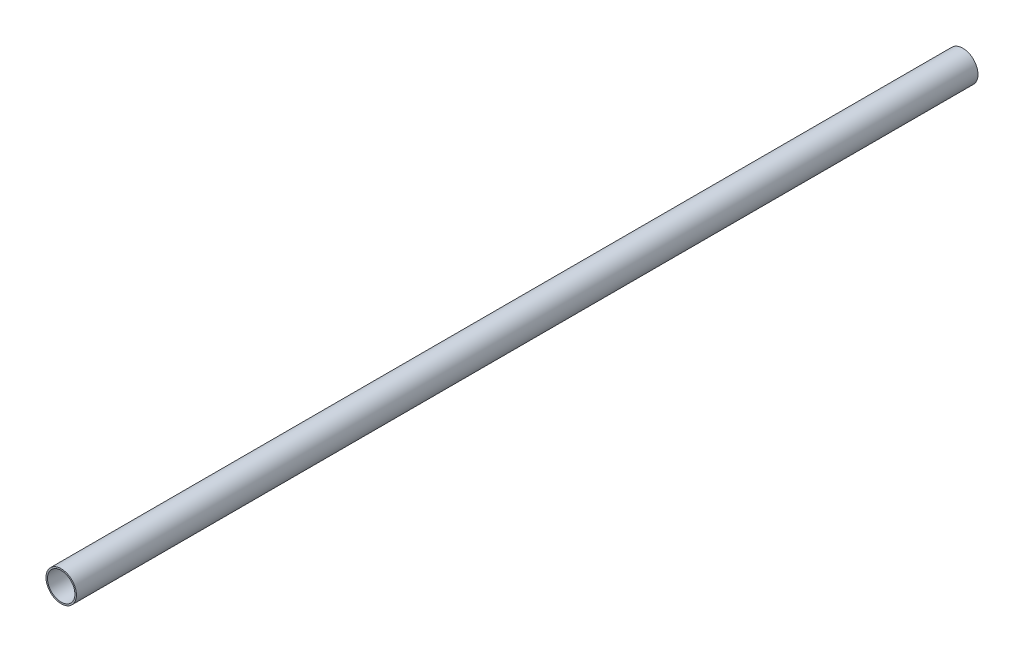
ISO-10303-21;
HEADER;
FILE_DESCRIPTION(('STEP AP214'),'2;1');
FILE_NAME('part.step','',(''),(''),'','','');
FILE_SCHEMA(('AUTOMOTIVE_DESIGN { 1 0 10303 214 1 1 1 1 }'));
ENDSEC;
DATA;
#1=APPLICATION_CONTEXT('core data for automotive mechanical design processes');
#2=APPLICATION_PROTOCOL_DEFINITION('international standard','automotive_design',2000,#1);
#3=PRODUCT_CONTEXT('',#1,'mechanical');
#4=PRODUCT('Part','Part','',(#3));
#5=PRODUCT_RELATED_PRODUCT_CATEGORY('part','',(#4));
#6=PRODUCT_DEFINITION_FORMATION('','',#4);
#7=PRODUCT_DEFINITION_CONTEXT('part definition',#1,'design');
#8=PRODUCT_DEFINITION('design','',#6,#7);
#9=PRODUCT_DEFINITION_SHAPE('','',#8);
#10=(LENGTH_UNIT() NAMED_UNIT(*) SI_UNIT(.MILLI.,.METRE.));
#11=(NAMED_UNIT(*) PLANE_ANGLE_UNIT() SI_UNIT($,.RADIAN.));
#12=(NAMED_UNIT(*) SI_UNIT($,.STERADIAN.) SOLID_ANGLE_UNIT());
#13=UNCERTAINTY_MEASURE_WITH_UNIT(LENGTH_MEASURE(1.E-05),#10,'distance_accuracy_value','');
#14=(GEOMETRIC_REPRESENTATION_CONTEXT(3) GLOBAL_UNCERTAINTY_ASSIGNED_CONTEXT((#13)) GLOBAL_UNIT_ASSIGNED_CONTEXT((#10,
#11,#12)) REPRESENTATION_CONTEXT('',''));
#15=CARTESIAN_POINT('',(0.,0.,0.));
#16=DIRECTION('',(0.,0.,1.));
#17=DIRECTION('',(1.,0.,0.));
#18=AXIS2_PLACEMENT_3D('',#15,#16,#17);
#19=CARTESIAN_POINT('',(0.,0.,752.856));
#20=DIRECTION('',(0.,0.,1.));
#21=DIRECTION('',(1.,0.,0.));
#22=AXIS2_PLACEMENT_3D('',#19,#20,#21);
#23=PLANE('',#22);
#24=CARTESIAN_POINT('',(0.,0.,752.856));
#25=DIRECTION('',(0.,0.,1.));
#26=DIRECTION('',(1.,0.,0.));
#27=AXIS2_PLACEMENT_3D('',#24,#25,#26);
#28=CIRCLE('',#27,12.7);
#29=CARTESIAN_POINT('',(12.7,0.,752.856));
#30=VERTEX_POINT('',#29);
#31=EDGE_CURVE('E10',#30,#30,#28,.T.);
#32=ORIENTED_EDGE('',*,*,#31,.T.);
#33=EDGE_LOOP('',(#32));
#34=FACE_BOUND('',#33,.T.);
#35=CARTESIAN_POINT('',(0.,0.,752.856));
#36=DIRECTION('',(0.,0.,1.));
#37=DIRECTION('',(1.,0.,0.));
#38=AXIS2_PLACEMENT_3D('',#35,#36,#37);
#39=CIRCLE('',#38,11.4554);
#40=CARTESIAN_POINT('',(11.4554,0.,752.856));
#41=VERTEX_POINT('',#40);
#42=EDGE_CURVE('E44',#41,#41,#39,.T.);
#43=ORIENTED_EDGE('',*,*,#42,.F.);
#44=EDGE_LOOP('',(#43));
#45=FACE_BOUND('',#44,.T.);
#46=ADVANCED_FACE('F33',(#34,#45),#23,.T.);
#47=CARTESIAN_POINT('',(0.,0.,0.));
#48=DIRECTION('',(0.,0.,1.));
#49=DIRECTION('',(1.,0.,0.));
#50=AXIS2_PLACEMENT_3D('',#47,#48,#49);
#51=PLANE('',#50);
#52=CARTESIAN_POINT('',(0.,0.,0.));
#53=DIRECTION('',(0.,0.,1.));
#54=DIRECTION('',(1.,0.,0.));
#55=AXIS2_PLACEMENT_3D('',#52,#53,#54);
#56=CIRCLE('',#55,12.7);
#57=CARTESIAN_POINT('',(12.7,0.,0.));
#58=VERTEX_POINT('',#57);
#59=EDGE_CURVE('E37',#58,#58,#56,.T.);
#60=ORIENTED_EDGE('',*,*,#59,.F.);
#61=EDGE_LOOP('',(#60));
#62=FACE_BOUND('',#61,.T.);
#63=CARTESIAN_POINT('',(0.,0.,0.));
#64=DIRECTION('',(0.,0.,1.));
#65=DIRECTION('',(1.,0.,0.));
#66=AXIS2_PLACEMENT_3D('',#63,#64,#65);
#67=CIRCLE('',#66,11.4554);
#68=CARTESIAN_POINT('',(11.4554,0.,0.));
#69=VERTEX_POINT('',#68);
#70=EDGE_CURVE('E46',#69,#69,#67,.T.);
#71=ORIENTED_EDGE('',*,*,#70,.T.);
#72=EDGE_LOOP('',(#71));
#73=FACE_BOUND('',#72,.T.);
#74=ADVANCED_FACE('F56',(#62,#73),#51,.F.);
#75=CARTESIAN_POINT('',(0.,0.,752.856));
#76=DIRECTION('',(0.,0.,-1.));
#77=DIRECTION('',(-1.,0.,0.));
#78=AXIS2_PLACEMENT_3D('',#75,#76,#77);
#79=CYLINDRICAL_SURFACE('',#78,12.7);
#80=ORIENTED_EDGE('',*,*,#31,.F.);
#81=EDGE_LOOP('',(#80));
#82=FACE_BOUND('',#81,.T.);
#83=ORIENTED_EDGE('',*,*,#59,.T.);
#84=EDGE_LOOP('',(#83));
#85=FACE_BOUND('',#84,.T.);
#86=ADVANCED_FACE('F35',(#82,#85),#79,.T.);
#87=CARTESIAN_POINT('',(0.,0.,752.856));
#88=DIRECTION('',(0.,0.,-1.));
#89=DIRECTION('',(-1.,0.,0.));
#90=AXIS2_PLACEMENT_3D('',#87,#88,#89);
#91=CYLINDRICAL_SURFACE('',#90,11.4554);
#92=ORIENTED_EDGE('',*,*,#42,.T.);
#93=EDGE_LOOP('',(#92));
#94=FACE_BOUND('',#93,.T.);
#95=ORIENTED_EDGE('',*,*,#70,.F.);
#96=EDGE_LOOP('',(#95));
#97=FACE_BOUND('',#96,.T.);
#98=ADVANCED_FACE('F52',(#94,#97),#91,.F.);
#99=CLOSED_SHELL('',(#46,#74,#86,#98));
#100=MANIFOLD_SOLID_BREP('B2',#99);
#101=ADVANCED_BREP_SHAPE_REPRESENTATION('',(#18,#100),#14);
#102=SHAPE_DEFINITION_REPRESENTATION(#9,#101);
ENDSEC;
END-ISO-10303-21;
